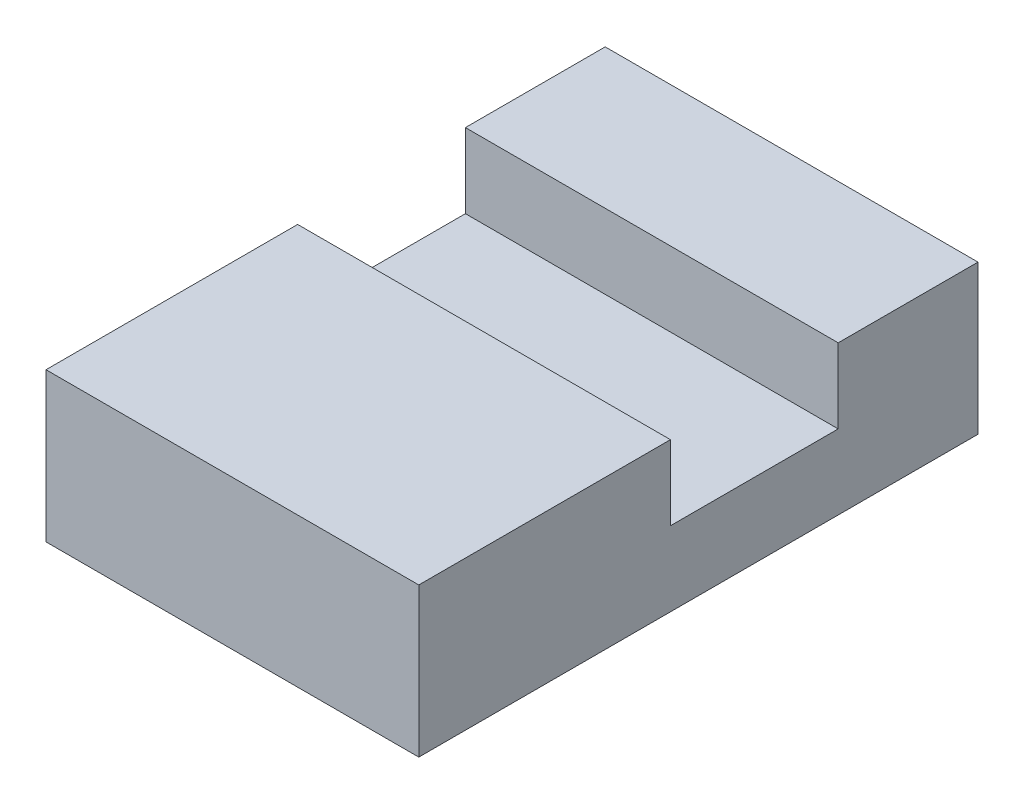
ISO-10303-21;
HEADER;
FILE_DESCRIPTION(('STEP AP214'),'2;1');
FILE_NAME('part.step','',(''),(''),'','','');
FILE_SCHEMA(('AUTOMOTIVE_DESIGN { 1 0 10303 214 1 1 1 1 }'));
ENDSEC;
DATA;
#1=APPLICATION_CONTEXT('core data for automotive mechanical design processes');
#2=APPLICATION_PROTOCOL_DEFINITION('international standard','automotive_design',2000,#1);
#3=PRODUCT_CONTEXT('',#1,'mechanical');
#4=PRODUCT('Part','Part','',(#3));
#5=PRODUCT_RELATED_PRODUCT_CATEGORY('part','',(#4));
#6=PRODUCT_DEFINITION_FORMATION('','',#4);
#7=PRODUCT_DEFINITION_CONTEXT('part definition',#1,'design');
#8=PRODUCT_DEFINITION('design','',#6,#7);
#9=PRODUCT_DEFINITION_SHAPE('','',#8);
#10=(LENGTH_UNIT() NAMED_UNIT(*) SI_UNIT(.MILLI.,.METRE.));
#11=(NAMED_UNIT(*) PLANE_ANGLE_UNIT() SI_UNIT($,.RADIAN.));
#12=(NAMED_UNIT(*) SI_UNIT($,.STERADIAN.) SOLID_ANGLE_UNIT());
#13=UNCERTAINTY_MEASURE_WITH_UNIT(LENGTH_MEASURE(1.E-05),#10,'distance_accuracy_value','');
#14=(GEOMETRIC_REPRESENTATION_CONTEXT(3) GLOBAL_UNCERTAINTY_ASSIGNED_CONTEXT((#13)) GLOBAL_UNIT_ASSIGNED_CONTEXT((#10,
#11,#12)) REPRESENTATION_CONTEXT('',''));
#15=CARTESIAN_POINT('',(0.,0.,0.));
#16=DIRECTION('',(0.,0.,1.));
#17=DIRECTION('',(1.,0.,0.));
#18=AXIS2_PLACEMENT_3D('',#15,#16,#17);
#19=CARTESIAN_POINT('',(0.,8.,0.));
#20=DIRECTION('',(0.,1.,0.));
#21=DIRECTION('',(0.,0.,1.));
#22=AXIS2_PLACEMENT_3D('',#19,#20,#21);
#23=PLANE('',#22);
#24=DIRECTION('',(1.,0.,0.));
#25=VECTOR('',#24,1.);
#26=CARTESIAN_POINT('',(-14.1818181818182,8.,-2.09090909090909));
#27=LINE('',#26,#25);
#28=CARTESIAN_POINT('',(-14.1818181818182,8.,-2.09090909090909));
#29=VERTEX_POINT('',#28);
#30=CARTESIAN_POINT('',(5.81818181818181,8.,-2.0909090909091));
#31=VERTEX_POINT('',#30);
#32=EDGE_CURVE('E115',#29,#31,#27,.T.);
#33=ORIENTED_EDGE('',*,*,#32,.T.);
#34=DIRECTION('',(0.,0.,-1.));
#35=VECTOR('',#34,1.);
#36=CARTESIAN_POINT('',(5.81818181818181,8.,-9.59090909090909));
#37=LINE('',#36,#35);
#38=CARTESIAN_POINT('',(5.81818181818181,8.,-9.59090909090909));
#39=VERTEX_POINT('',#38);
#40=EDGE_CURVE('E139',#31,#39,#37,.T.);
#41=ORIENTED_EDGE('',*,*,#40,.T.);
#42=DIRECTION('',(-1.,0.,0.));
#43=VECTOR('',#42,1.);
#44=CARTESIAN_POINT('',(-14.1818181818182,8.,-9.59090909090909));
#45=LINE('',#44,#43);
#46=CARTESIAN_POINT('',(-14.1818181818182,8.,-9.59090909090909));
#47=VERTEX_POINT('',#46);
#48=EDGE_CURVE('E64',#39,#47,#45,.T.);
#49=ORIENTED_EDGE('',*,*,#48,.T.);
#50=DIRECTION('',(0.,0.,1.));
#51=VECTOR('',#50,1.);
#52=CARTESIAN_POINT('',(-14.1818181818182,8.,-9.59090909090909));
#53=LINE('',#52,#51);
#54=EDGE_CURVE('E129',#47,#29,#53,.T.);
#55=ORIENTED_EDGE('',*,*,#54,.T.);
#56=EDGE_LOOP('',(#33,#41,#49,#55));
#57=FACE_BOUND('',#56,.T.);
#58=ADVANCED_FACE('F39',(#57),#23,.T.);
#59=CARTESIAN_POINT('',(-14.1818181818182,8.,-9.59090909090909));
#60=DIRECTION('',(1.,0.,0.));
#61=DIRECTION('',(0.,0.,-1.));
#62=AXIS2_PLACEMENT_3D('',#59,#60,#61);
#63=PLANE('',#62);
#64=DIRECTION('',(0.,0.,-1.));
#65=VECTOR('',#64,1.);
#66=CARTESIAN_POINT('',(-14.1818181818182,4.,-2.09090909090909));
#67=LINE('',#66,#65);
#68=CARTESIAN_POINT('',(-14.1818181818182,4.,6.90909090909091));
#69=VERTEX_POINT('',#68);
#70=CARTESIAN_POINT('',(-14.1818181818182,4.,-2.09090909090909));
#71=VERTEX_POINT('',#70);
#72=EDGE_CURVE('E125',#69,#71,#67,.T.);
#73=ORIENTED_EDGE('',*,*,#72,.T.);
#74=DIRECTION('',(0.,1.,0.));
#75=VECTOR('',#74,1.);
#76=CARTESIAN_POINT('',(-14.1818181818182,8.,-2.09090909090909));
#77=LINE('',#76,#75);
#78=EDGE_CURVE('E118',#71,#29,#77,.T.);
#79=ORIENTED_EDGE('',*,*,#78,.T.);
#80=ORIENTED_EDGE('',*,*,#54,.F.);
#81=DIRECTION('',(0.,-1.,0.));
#82=VECTOR('',#81,1.);
#83=CARTESIAN_POINT('',(-14.1818181818182,8.,-9.59090909090909));
#84=LINE('',#83,#82);
#85=CARTESIAN_POINT('',(-14.1818181818182,0.,-9.59090909090909));
#86=VERTEX_POINT('',#85);
#87=EDGE_CURVE('E149',#47,#86,#84,.T.);
#88=ORIENTED_EDGE('',*,*,#87,.T.);
#89=DIRECTION('',(0.,0.,1.));
#90=VECTOR('',#89,1.);
#91=CARTESIAN_POINT('',(-14.1818181818182,0.,-9.59090909090909));
#92=LINE('',#91,#90);
#93=CARTESIAN_POINT('',(-14.1818181818182,0.,20.4090909090909));
#94=VERTEX_POINT('',#93);
#95=EDGE_CURVE('E150',#86,#94,#92,.T.);
#96=ORIENTED_EDGE('',*,*,#95,.T.);
#97=DIRECTION('',(0.,-1.,0.));
#98=VECTOR('',#97,1.);
#99=CARTESIAN_POINT('',(-14.1818181818182,8.,20.4090909090909));
#100=LINE('',#99,#98);
#101=CARTESIAN_POINT('',(-14.1818181818182,8.,20.4090909090909));
#102=VERTEX_POINT('',#101);
#103=EDGE_CURVE('E11',#102,#94,#100,.T.);
#104=ORIENTED_EDGE('',*,*,#103,.F.);
#105=CARTESIAN_POINT('',(-14.1818181818182,8.,6.90909090909091));
#106=VERTEX_POINT('',#105);
#107=EDGE_CURVE('E92',#106,#102,#53,.T.);
#108=ORIENTED_EDGE('',*,*,#107,.F.);
#109=DIRECTION('',(0.,-1.,0.));
#110=VECTOR('',#109,1.);
#111=CARTESIAN_POINT('',(-14.1818181818182,8.,6.90909090909091));
#112=LINE('',#111,#110);
#113=EDGE_CURVE('E55',#106,#69,#112,.T.);
#114=ORIENTED_EDGE('',*,*,#113,.T.);
#115=EDGE_LOOP('',(#73,#79,#80,#88,#96,#104,#108,#114));
#116=FACE_BOUND('',#115,.T.);
#117=ADVANCED_FACE('F41',(#116),#63,.F.);
#118=CARTESIAN_POINT('',(-14.1818181818182,8.,20.4090909090909));
#119=DIRECTION('',(0.,0.,-1.));
#120=DIRECTION('',(-1.,0.,0.));
#121=AXIS2_PLACEMENT_3D('',#118,#119,#120);
#122=PLANE('',#121);
#123=DIRECTION('',(1.,0.,0.));
#124=VECTOR('',#123,1.);
#125=CARTESIAN_POINT('',(-14.1818181818182,0.,20.4090909090909));
#126=LINE('',#125,#124);
#127=CARTESIAN_POINT('',(5.81818181818182,0.,20.4090909090909));
#128=VERTEX_POINT('',#127);
#129=EDGE_CURVE('E154',#94,#128,#126,.T.);
#130=ORIENTED_EDGE('',*,*,#129,.T.);
#131=DIRECTION('',(0.,-1.,0.));
#132=VECTOR('',#131,1.);
#133=CARTESIAN_POINT('',(5.81818181818182,8.,20.4090909090909));
#134=LINE('',#133,#132);
#135=CARTESIAN_POINT('',(5.81818181818182,8.,20.4090909090909));
#136=VERTEX_POINT('',#135);
#137=EDGE_CURVE('E48',#136,#128,#134,.T.);
#138=ORIENTED_EDGE('',*,*,#137,.F.);
#139=DIRECTION('',(1.,0.,0.));
#140=VECTOR('',#139,1.);
#141=CARTESIAN_POINT('',(-14.1818181818182,8.,20.4090909090909));
#142=LINE('',#141,#140);
#143=EDGE_CURVE('E135',#102,#136,#142,.T.);
#144=ORIENTED_EDGE('',*,*,#143,.F.);
#145=ORIENTED_EDGE('',*,*,#103,.T.);
#146=EDGE_LOOP('',(#130,#138,#144,#145));
#147=FACE_BOUND('',#146,.T.);
#148=ADVANCED_FACE('F203',(#147),#122,.F.);
#149=CARTESIAN_POINT('',(5.81818181818181,8.,-9.59090909090909));
#150=DIRECTION('',(-1.,0.,0.));
#151=DIRECTION('',(0.,0.,1.));
#152=AXIS2_PLACEMENT_3D('',#149,#150,#151);
#153=PLANE('',#152);
#154=ORIENTED_EDGE('',*,*,#40,.F.);
#155=DIRECTION('',(0.,1.,0.));
#156=VECTOR('',#155,1.);
#157=CARTESIAN_POINT('',(5.81818181818181,8.,-2.0909090909091));
#158=LINE('',#157,#156);
#159=CARTESIAN_POINT('',(5.81818181818181,4.,-2.09090909090909));
#160=VERTEX_POINT('',#159);
#161=EDGE_CURVE('E121',#160,#31,#158,.T.);
#162=ORIENTED_EDGE('',*,*,#161,.F.);
#163=DIRECTION('',(0.,0.,-1.));
#164=VECTOR('',#163,1.);
#165=CARTESIAN_POINT('',(5.81818181818181,4.,-2.09090909090909));
#166=LINE('',#165,#164);
#167=CARTESIAN_POINT('',(5.81818181818181,4.,6.90909090909091));
#168=VERTEX_POINT('',#167);
#169=EDGE_CURVE('E132',#168,#160,#166,.T.);
#170=ORIENTED_EDGE('',*,*,#169,.F.);
#171=DIRECTION('',(0.,-1.,0.));
#172=VECTOR('',#171,1.);
#173=CARTESIAN_POINT('',(5.81818181818181,8.,6.9090909090909));
#174=LINE('',#173,#172);
#175=CARTESIAN_POINT('',(5.81818181818181,8.,6.9090909090909));
#176=VERTEX_POINT('',#175);
#177=EDGE_CURVE('E186',#176,#168,#174,.T.);
#178=ORIENTED_EDGE('',*,*,#177,.F.);
#179=EDGE_CURVE('E143',#136,#176,#37,.T.);
#180=ORIENTED_EDGE('',*,*,#179,.F.);
#181=ORIENTED_EDGE('',*,*,#137,.T.);
#182=DIRECTION('',(0.,0.,-1.));
#183=VECTOR('',#182,1.);
#184=CARTESIAN_POINT('',(5.81818181818181,0.,-9.59090909090909));
#185=LINE('',#184,#183);
#186=CARTESIAN_POINT('',(5.81818181818181,0.,-9.59090909090909));
#187=VERTEX_POINT('',#186);
#188=EDGE_CURVE('E158',#128,#187,#185,.T.);
#189=ORIENTED_EDGE('',*,*,#188,.T.);
#190=DIRECTION('',(0.,-1.,0.));
#191=VECTOR('',#190,1.);
#192=CARTESIAN_POINT('',(5.81818181818181,8.,-9.59090909090909));
#193=LINE('',#192,#191);
#194=EDGE_CURVE('E165',#39,#187,#193,.T.);
#195=ORIENTED_EDGE('',*,*,#194,.F.);
#196=EDGE_LOOP('',(#154,#162,#170,#178,#180,#181,#189,#195));
#197=FACE_BOUND('',#196,.T.);
#198=ADVANCED_FACE('F173',(#197),#153,.F.);
#199=CARTESIAN_POINT('',(-14.1818181818182,8.,-9.59090909090909));
#200=DIRECTION('',(0.,0.,1.));
#201=DIRECTION('',(1.,0.,0.));
#202=AXIS2_PLACEMENT_3D('',#199,#200,#201);
#203=PLANE('',#202);
#204=DIRECTION('',(-1.,0.,0.));
#205=VECTOR('',#204,1.);
#206=CARTESIAN_POINT('',(-14.1818181818182,0.,-9.59090909090909));
#207=LINE('',#206,#205);
#208=EDGE_CURVE('E85',#187,#86,#207,.T.);
#209=ORIENTED_EDGE('',*,*,#208,.T.);
#210=ORIENTED_EDGE('',*,*,#87,.F.);
#211=ORIENTED_EDGE('',*,*,#48,.F.);
#212=ORIENTED_EDGE('',*,*,#194,.T.);
#213=EDGE_LOOP('',(#209,#210,#211,#212));
#214=FACE_BOUND('',#213,.T.);
#215=ADVANCED_FACE('F181',(#214),#203,.F.);
#216=DIRECTION('',(1.,0.,0.));
#217=VECTOR('',#216,1.);
#218=CARTESIAN_POINT('',(-14.1818181818182,8.,6.90909090909091));
#219=LINE('',#218,#217);
#220=EDGE_CURVE('E124',#106,#176,#219,.T.);
#221=ORIENTED_EDGE('',*,*,#220,.F.);
#222=ORIENTED_EDGE('',*,*,#107,.T.);
#223=ORIENTED_EDGE('',*,*,#143,.T.);
#224=ORIENTED_EDGE('',*,*,#179,.T.);
#225=EDGE_LOOP('',(#221,#222,#223,#224));
#226=FACE_BOUND('',#225,.T.);
#227=ADVANCED_FACE('F202',(#226),#23,.T.);
#228=CARTESIAN_POINT('',(0.,0.,0.));
#229=DIRECTION('',(0.,1.,0.));
#230=DIRECTION('',(0.,0.,1.));
#231=AXIS2_PLACEMENT_3D('',#228,#229,#230);
#232=PLANE('',#231);
#233=ORIENTED_EDGE('',*,*,#95,.F.);
#234=ORIENTED_EDGE('',*,*,#208,.F.);
#235=ORIENTED_EDGE('',*,*,#188,.F.);
#236=ORIENTED_EDGE('',*,*,#129,.F.);
#237=EDGE_LOOP('',(#233,#234,#235,#236));
#238=FACE_BOUND('',#237,.T.);
#239=ADVANCED_FACE('F179',(#238),#232,.F.);
#240=CARTESIAN_POINT('',(-14.1818181818182,8.,-2.09090909090909));
#241=DIRECTION('',(0.,0.,-1.));
#242=DIRECTION('',(0.,1.,0.));
#243=AXIS2_PLACEMENT_3D('',#240,#241,#242);
#244=PLANE('',#243);
#245=ORIENTED_EDGE('',*,*,#161,.T.);
#246=ORIENTED_EDGE('',*,*,#32,.F.);
#247=ORIENTED_EDGE('',*,*,#78,.F.);
#248=DIRECTION('',(1.,0.,0.));
#249=VECTOR('',#248,1.);
#250=CARTESIAN_POINT('',(-14.1818181818182,4.,-2.09090909090909));
#251=LINE('',#250,#249);
#252=EDGE_CURVE('E155',#71,#160,#251,.T.);
#253=ORIENTED_EDGE('',*,*,#252,.T.);
#254=EDGE_LOOP('',(#245,#246,#247,#253));
#255=FACE_BOUND('',#254,.T.);
#256=ADVANCED_FACE('F117',(#255),#244,.F.);
#257=CARTESIAN_POINT('',(-14.1818181818182,4.,-2.09090909090909));
#258=DIRECTION('',(0.,-1.,0.));
#259=DIRECTION('',(0.,0.,-1.));
#260=AXIS2_PLACEMENT_3D('',#257,#258,#259);
#261=PLANE('',#260);
#262=ORIENTED_EDGE('',*,*,#169,.T.);
#263=ORIENTED_EDGE('',*,*,#252,.F.);
#264=ORIENTED_EDGE('',*,*,#72,.F.);
#265=DIRECTION('',(1.,0.,0.));
#266=VECTOR('',#265,1.);
#267=CARTESIAN_POINT('',(-14.1818181818182,4.,6.90909090909091));
#268=LINE('',#267,#266);
#269=EDGE_CURVE('E198',#69,#168,#268,.T.);
#270=ORIENTED_EDGE('',*,*,#269,.T.);
#271=EDGE_LOOP('',(#262,#263,#264,#270));
#272=FACE_BOUND('',#271,.T.);
#273=ADVANCED_FACE('F247',(#272),#261,.F.);
#274=CARTESIAN_POINT('',(-14.1818181818182,8.,6.90909090909091));
#275=DIRECTION('',(0.,0.,1.));
#276=DIRECTION('',(0.,-1.,0.));
#277=AXIS2_PLACEMENT_3D('',#274,#275,#276);
#278=PLANE('',#277);
#279=ORIENTED_EDGE('',*,*,#177,.T.);
#280=ORIENTED_EDGE('',*,*,#269,.F.);
#281=ORIENTED_EDGE('',*,*,#113,.F.);
#282=ORIENTED_EDGE('',*,*,#220,.T.);
#283=EDGE_LOOP('',(#279,#280,#281,#282));
#284=FACE_BOUND('',#283,.T.);
#285=ADVANCED_FACE('F201',(#284),#278,.F.);
#286=CLOSED_SHELL('',(#58,#117,#148,#198,#215,#227,#239,#256,#273,#285));
#287=MANIFOLD_SOLID_BREP('B2',#286);
#288=ADVANCED_BREP_SHAPE_REPRESENTATION('',(#18,#287),#14);
#289=SHAPE_DEFINITION_REPRESENTATION(#9,#288);
ENDSEC;
END-ISO-10303-21;
